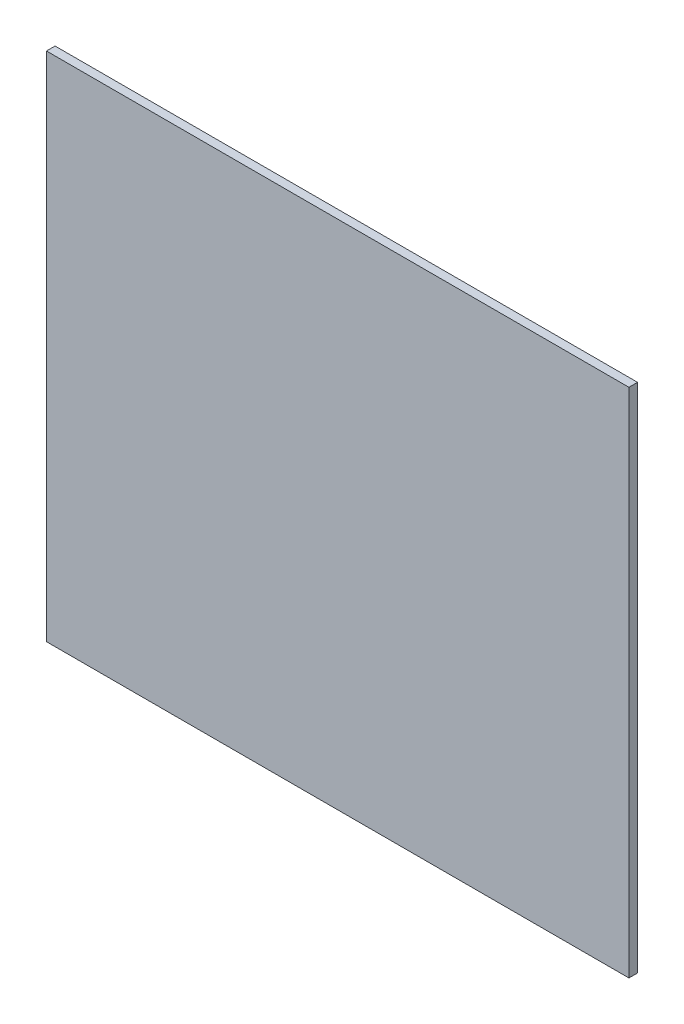
ISO-10303-21;
HEADER;
FILE_DESCRIPTION(('STEP AP214'),'2;1');
FILE_NAME('part.step','',(''),(''),'','','');
FILE_SCHEMA(('AUTOMOTIVE_DESIGN { 1 0 10303 214 1 1 1 1 }'));
ENDSEC;
DATA;
#1=APPLICATION_CONTEXT('core data for automotive mechanical design processes');
#2=APPLICATION_PROTOCOL_DEFINITION('international standard','automotive_design',2000,#1);
#3=PRODUCT_CONTEXT('',#1,'mechanical');
#4=PRODUCT('Part','Part','',(#3));
#5=PRODUCT_RELATED_PRODUCT_CATEGORY('part','',(#4));
#6=PRODUCT_DEFINITION_FORMATION('','',#4);
#7=PRODUCT_DEFINITION_CONTEXT('part definition',#1,'design');
#8=PRODUCT_DEFINITION('design','',#6,#7);
#9=PRODUCT_DEFINITION_SHAPE('','',#8);
#10=(LENGTH_UNIT() NAMED_UNIT(*) SI_UNIT(.MILLI.,.METRE.));
#11=(NAMED_UNIT(*) PLANE_ANGLE_UNIT() SI_UNIT($,.RADIAN.));
#12=(NAMED_UNIT(*) SI_UNIT($,.STERADIAN.) SOLID_ANGLE_UNIT());
#13=UNCERTAINTY_MEASURE_WITH_UNIT(LENGTH_MEASURE(1.E-05),#10,'distance_accuracy_value','');
#14=(GEOMETRIC_REPRESENTATION_CONTEXT(3) GLOBAL_UNCERTAINTY_ASSIGNED_CONTEXT((#13)) GLOBAL_UNIT_ASSIGNED_CONTEXT((#10,
#11,#12)) REPRESENTATION_CONTEXT('',''));
#15=CARTESIAN_POINT('',(0.,0.,0.));
#16=DIRECTION('',(0.,0.,1.));
#17=DIRECTION('',(1.,0.,0.));
#18=AXIS2_PLACEMENT_3D('',#15,#16,#17);
#19=CARTESIAN_POINT('',(16.3637508024896,108.385409654221,1.7));
#20=DIRECTION('',(1.,0.,0.));
#21=DIRECTION('',(0.,1.,0.));
#22=AXIS2_PLACEMENT_3D('',#19,#20,#21);
#23=PLANE('',#22);
#24=DIRECTION('',(0.,-1.,0.));
#25=VECTOR('',#24,1.);
#26=CARTESIAN_POINT('',(16.3637508024896,108.385409654221,0.));
#27=LINE('',#26,#25);
#28=CARTESIAN_POINT('',(16.3637508024896,108.385409654221,0.));
#29=VERTEX_POINT('',#28);
#30=CARTESIAN_POINT('',(16.3637508024896,7.38540965422096,0.));
#31=VERTEX_POINT('',#30);
#32=EDGE_CURVE('E98',#29,#31,#27,.T.);
#33=ORIENTED_EDGE('',*,*,#32,.T.);
#34=DIRECTION('',(0.,0.,-1.));
#35=VECTOR('',#34,1.);
#36=CARTESIAN_POINT('',(16.3637508024896,7.38540965422096,1.7));
#37=LINE('',#36,#35);
#38=CARTESIAN_POINT('',(16.3637508024896,7.38540965422096,1.7));
#39=VERTEX_POINT('',#38);
#40=EDGE_CURVE('E11',#39,#31,#37,.T.);
#41=ORIENTED_EDGE('',*,*,#40,.F.);
#42=DIRECTION('',(0.,-1.,0.));
#43=VECTOR('',#42,1.);
#44=CARTESIAN_POINT('',(16.3637508024896,108.385409654221,1.7));
#45=LINE('',#44,#43);
#46=CARTESIAN_POINT('',(16.3637508024896,108.385409654221,1.7));
#47=VERTEX_POINT('',#46);
#48=EDGE_CURVE('E86',#47,#39,#45,.T.);
#49=ORIENTED_EDGE('',*,*,#48,.F.);
#50=DIRECTION('',(0.,0.,-1.));
#51=VECTOR('',#50,1.);
#52=CARTESIAN_POINT('',(16.3637508024896,108.385409654221,1.7));
#53=LINE('',#52,#51);
#54=EDGE_CURVE('E94',#47,#29,#53,.T.);
#55=ORIENTED_EDGE('',*,*,#54,.T.);
#56=EDGE_LOOP('',(#33,#41,#49,#55));
#57=FACE_BOUND('',#56,.T.);
#58=ADVANCED_FACE('F35',(#57),#23,.F.);
#59=CARTESIAN_POINT('',(16.3637508024896,7.38540965422096,1.7));
#60=DIRECTION('',(0.,1.,0.));
#61=DIRECTION('',(0.,0.,1.));
#62=AXIS2_PLACEMENT_3D('',#59,#60,#61);
#63=PLANE('',#62);
#64=DIRECTION('',(1.,0.,0.));
#65=VECTOR('',#64,1.);
#66=CARTESIAN_POINT('',(16.3637508024896,7.38540965422096,0.));
#67=LINE('',#66,#65);
#68=CARTESIAN_POINT('',(131.36375080249,7.38540965422096,0.));
#69=VERTEX_POINT('',#68);
#70=EDGE_CURVE('E90',#31,#69,#67,.T.);
#71=ORIENTED_EDGE('',*,*,#70,.T.);
#72=DIRECTION('',(0.,0.,-1.));
#73=VECTOR('',#72,1.);
#74=CARTESIAN_POINT('',(131.36375080249,7.38540965422096,1.7));
#75=LINE('',#74,#73);
#76=CARTESIAN_POINT('',(131.36375080249,7.38540965422096,1.7));
#77=VERTEX_POINT('',#76);
#78=EDGE_CURVE('E43',#77,#69,#75,.T.);
#79=ORIENTED_EDGE('',*,*,#78,.F.);
#80=DIRECTION('',(1.,0.,0.));
#81=VECTOR('',#80,1.);
#82=CARTESIAN_POINT('',(16.3637508024896,7.38540965422096,1.7));
#83=LINE('',#82,#81);
#84=EDGE_CURVE('E81',#39,#77,#83,.T.);
#85=ORIENTED_EDGE('',*,*,#84,.F.);
#86=ORIENTED_EDGE('',*,*,#40,.T.);
#87=EDGE_LOOP('',(#71,#79,#85,#86));
#88=FACE_BOUND('',#87,.T.);
#89=ADVANCED_FACE('F89',(#88),#63,.F.);
#90=CARTESIAN_POINT('',(131.36375080249,108.385409654221,1.7));
#91=DIRECTION('',(-1.,0.,0.));
#92=DIRECTION('',(0.,0.,1.));
#93=AXIS2_PLACEMENT_3D('',#90,#91,#92);
#94=PLANE('',#93);
#95=DIRECTION('',(0.,1.,0.));
#96=VECTOR('',#95,1.);
#97=CARTESIAN_POINT('',(131.36375080249,108.385409654221,0.));
#98=LINE('',#97,#96);
#99=CARTESIAN_POINT('',(131.36375080249,108.385409654221,0.));
#100=VERTEX_POINT('',#99);
#101=EDGE_CURVE('E68',#69,#100,#98,.T.);
#102=ORIENTED_EDGE('',*,*,#101,.T.);
#103=DIRECTION('',(0.,0.,-1.));
#104=VECTOR('',#103,1.);
#105=CARTESIAN_POINT('',(131.36375080249,108.385409654221,1.7));
#106=LINE('',#105,#104);
#107=CARTESIAN_POINT('',(131.36375080249,108.385409654221,1.7));
#108=VERTEX_POINT('',#107);
#109=EDGE_CURVE('E91',#108,#100,#106,.T.);
#110=ORIENTED_EDGE('',*,*,#109,.F.);
#111=DIRECTION('',(0.,1.,0.));
#112=VECTOR('',#111,1.);
#113=CARTESIAN_POINT('',(131.36375080249,108.385409654221,1.7));
#114=LINE('',#113,#112);
#115=EDGE_CURVE('E84',#77,#108,#114,.T.);
#116=ORIENTED_EDGE('',*,*,#115,.F.);
#117=ORIENTED_EDGE('',*,*,#78,.T.);
#118=EDGE_LOOP('',(#102,#110,#116,#117));
#119=FACE_BOUND('',#118,.T.);
#120=ADVANCED_FACE('F92',(#119),#94,.F.);
#121=CARTESIAN_POINT('',(16.3637508024896,108.385409654221,1.7));
#122=DIRECTION('',(0.,-1.,0.));
#123=DIRECTION('',(0.,0.,-1.));
#124=AXIS2_PLACEMENT_3D('',#121,#122,#123);
#125=PLANE('',#124);
#126=DIRECTION('',(-1.,0.,0.));
#127=VECTOR('',#126,1.);
#128=CARTESIAN_POINT('',(16.3637508024896,108.385409654221,0.));
#129=LINE('',#128,#127);
#130=EDGE_CURVE('E74',#100,#29,#129,.T.);
#131=ORIENTED_EDGE('',*,*,#130,.T.);
#132=ORIENTED_EDGE('',*,*,#54,.F.);
#133=DIRECTION('',(-1.,0.,0.));
#134=VECTOR('',#133,1.);
#135=CARTESIAN_POINT('',(16.3637508024896,108.385409654221,1.7));
#136=LINE('',#135,#134);
#137=EDGE_CURVE('E51',#108,#47,#136,.T.);
#138=ORIENTED_EDGE('',*,*,#137,.F.);
#139=ORIENTED_EDGE('',*,*,#109,.T.);
#140=EDGE_LOOP('',(#131,#132,#138,#139));
#141=FACE_BOUND('',#140,.T.);
#142=ADVANCED_FACE('F105',(#141),#125,.F.);
#143=CARTESIAN_POINT('',(0.,0.,1.7));
#144=DIRECTION('',(0.,0.,1.));
#145=DIRECTION('',(1.,0.,0.));
#146=AXIS2_PLACEMENT_3D('',#143,#144,#145);
#147=PLANE('',#146);
#148=ORIENTED_EDGE('',*,*,#48,.T.);
#149=ORIENTED_EDGE('',*,*,#84,.T.);
#150=ORIENTED_EDGE('',*,*,#115,.T.);
#151=ORIENTED_EDGE('',*,*,#137,.T.);
#152=EDGE_LOOP('',(#148,#149,#150,#151));
#153=FACE_BOUND('',#152,.T.);
#154=ADVANCED_FACE('F82',(#153),#147,.T.);
#155=CARTESIAN_POINT('',(0.,0.,0.));
#156=DIRECTION('',(0.,0.,1.));
#157=DIRECTION('',(1.,0.,0.));
#158=AXIS2_PLACEMENT_3D('',#155,#156,#157);
#159=PLANE('',#158);
#160=ORIENTED_EDGE('',*,*,#32,.F.);
#161=ORIENTED_EDGE('',*,*,#130,.F.);
#162=ORIENTED_EDGE('',*,*,#101,.F.);
#163=ORIENTED_EDGE('',*,*,#70,.F.);
#164=EDGE_LOOP('',(#160,#161,#162,#163));
#165=FACE_BOUND('',#164,.T.);
#166=ADVANCED_FACE('F108',(#165),#159,.F.);
#167=CLOSED_SHELL('',(#58,#89,#120,#142,#154,#166));
#168=MANIFOLD_SOLID_BREP('B2',#167);
#169=ADVANCED_BREP_SHAPE_REPRESENTATION('',(#18,#168),#14);
#170=SHAPE_DEFINITION_REPRESENTATION(#9,#169);
ENDSEC;
END-ISO-10303-21;
